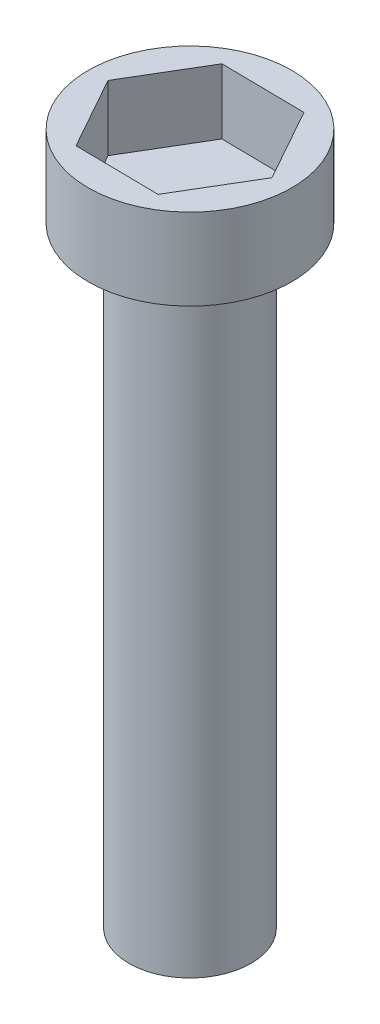
ISO-10303-21;
HEADER;
FILE_DESCRIPTION(('STEP AP214'),'2;1');
FILE_NAME('part.step','',(''),(''),'','','');
FILE_SCHEMA(('AUTOMOTIVE_DESIGN { 1 0 10303 214 1 1 1 1 }'));
ENDSEC;
DATA;
#1=APPLICATION_CONTEXT('core data for automotive mechanical design processes');
#2=APPLICATION_PROTOCOL_DEFINITION('international standard','automotive_design',2000,#1);
#3=PRODUCT_CONTEXT('',#1,'mechanical');
#4=PRODUCT('Part','Part','',(#3));
#5=PRODUCT_RELATED_PRODUCT_CATEGORY('part','',(#4));
#6=PRODUCT_DEFINITION_FORMATION('','',#4);
#7=PRODUCT_DEFINITION_CONTEXT('part definition',#1,'design');
#8=PRODUCT_DEFINITION('design','',#6,#7);
#9=PRODUCT_DEFINITION_SHAPE('','',#8);
#10=(LENGTH_UNIT() NAMED_UNIT(*) SI_UNIT(.MILLI.,.METRE.));
#11=(NAMED_UNIT(*) PLANE_ANGLE_UNIT() SI_UNIT($,.RADIAN.));
#12=(NAMED_UNIT(*) SI_UNIT($,.STERADIAN.) SOLID_ANGLE_UNIT());
#13=UNCERTAINTY_MEASURE_WITH_UNIT(LENGTH_MEASURE(1.E-05),#10,'distance_accuracy_value','');
#14=(GEOMETRIC_REPRESENTATION_CONTEXT(3) GLOBAL_UNCERTAINTY_ASSIGNED_CONTEXT((#13)) GLOBAL_UNIT_ASSIGNED_CONTEXT((#10,
#11,#12)) REPRESENTATION_CONTEXT('',''));
#15=CARTESIAN_POINT('',(0.,0.,0.));
#16=DIRECTION('',(0.,0.,1.));
#17=DIRECTION('',(1.,0.,0.));
#18=AXIS2_PLACEMENT_3D('',#15,#16,#17);
#19=CARTESIAN_POINT('',(0.,15.,0.));
#20=DIRECTION('',(0.,-1.,0.));
#21=DIRECTION('',(0.,0.,-1.));
#22=AXIS2_PLACEMENT_3D('',#19,#20,#21);
#23=CYLINDRICAL_SURFACE('',#22,1.5);
#24=CARTESIAN_POINT('',(0.,15.,0.));
#25=DIRECTION('',(0.,1.,0.));
#26=DIRECTION('',(0.,0.,1.));
#27=AXIS2_PLACEMENT_3D('',#24,#25,#26);
#28=CIRCLE('',#27,1.5);
#29=CARTESIAN_POINT('',(0.,15.,1.5));
#30=VERTEX_POINT('',#29);
#31=EDGE_CURVE('E11',#30,#30,#28,.T.);
#32=ORIENTED_EDGE('',*,*,#31,.F.);
#33=EDGE_LOOP('',(#32));
#34=FACE_BOUND('',#33,.T.);
#35=CARTESIAN_POINT('',(0.,0.,0.));
#36=DIRECTION('',(0.,1.,0.));
#37=DIRECTION('',(0.,0.,1.));
#38=AXIS2_PLACEMENT_3D('',#35,#36,#37);
#39=CIRCLE('',#38,1.5);
#40=CARTESIAN_POINT('',(0.,0.,1.5));
#41=VERTEX_POINT('',#40);
#42=EDGE_CURVE('E46',#41,#41,#39,.T.);
#43=ORIENTED_EDGE('',*,*,#42,.T.);
#44=EDGE_LOOP('',(#43));
#45=FACE_BOUND('',#44,.T.);
#46=ADVANCED_FACE('F43',(#34,#45),#23,.T.);
#47=CARTESIAN_POINT('',(0.,0.,0.));
#48=DIRECTION('',(0.,1.,0.));
#49=DIRECTION('',(0.,0.,1.));
#50=AXIS2_PLACEMENT_3D('',#47,#48,#49);
#51=PLANE('',#50);
#52=ORIENTED_EDGE('',*,*,#42,.F.);
#53=EDGE_LOOP('',(#52));
#54=FACE_BOUND('',#53,.T.);
#55=ADVANCED_FACE('F193',(#54),#51,.F.);
#56=CARTESIAN_POINT('',(0.,17.,0.));
#57=DIRECTION('',(0.,-1.,0.));
#58=DIRECTION('',(0.,0.,-1.));
#59=AXIS2_PLACEMENT_3D('',#56,#57,#58);
#60=CYLINDRICAL_SURFACE('',#59,2.5);
#61=CARTESIAN_POINT('',(0.,17.,0.));
#62=DIRECTION('',(0.,1.,0.));
#63=DIRECTION('',(0.,0.,1.));
#64=AXIS2_PLACEMENT_3D('',#61,#62,#63);
#65=CIRCLE('',#64,2.5);
#66=CARTESIAN_POINT('',(0.,17.,2.5));
#67=VERTEX_POINT('',#66);
#68=EDGE_CURVE('E167',#67,#67,#65,.T.);
#69=ORIENTED_EDGE('',*,*,#68,.F.);
#70=EDGE_LOOP('',(#69));
#71=FACE_BOUND('',#70,.T.);
#72=CARTESIAN_POINT('',(0.,15.,0.));
#73=DIRECTION('',(0.,1.,0.));
#74=DIRECTION('',(0.,0.,1.));
#75=AXIS2_PLACEMENT_3D('',#72,#73,#74);
#76=CIRCLE('',#75,2.5);
#77=CARTESIAN_POINT('',(0.,15.,2.5));
#78=VERTEX_POINT('',#77);
#79=EDGE_CURVE('E157',#78,#78,#76,.T.);
#80=ORIENTED_EDGE('',*,*,#79,.T.);
#81=EDGE_LOOP('',(#80));
#82=FACE_BOUND('',#81,.T.);
#83=ADVANCED_FACE('F175',(#71,#82),#60,.T.);
#84=CARTESIAN_POINT('',(0.,17.,0.));
#85=DIRECTION('',(0.,1.,0.));
#86=DIRECTION('',(0.,0.,1.));
#87=AXIS2_PLACEMENT_3D('',#84,#85,#86);
#88=PLANE('',#87);
#89=DIRECTION('',(0.999910905466136,0.,0.013348450467837));
#90=VECTOR('',#89,1.);
#91=CARTESIAN_POINT('',(-1.04431865035052,17.,1.75430812493096));
#92=LINE('',#91,#90);
#93=CARTESIAN_POINT('',(-1.04431865035052,17.,1.75430812493096));
#94=VERTEX_POINT('',#93);
#95=CARTESIAN_POINT('',(0.997116077080399,17.,1.78156054331491));
#96=VERTEX_POINT('',#95);
#97=EDGE_CURVE('E58',#94,#96,#92,.T.);
#98=ORIENTED_EDGE('',*,*,#97,.F.);
#99=DIRECTION('',(0.488395355526763,0.,0.872622470888692));
#100=VECTOR('',#99,1.);
#101=CARTESIAN_POINT('',(-2.04143472743092,17.,-0.0272524183839453));
#102=LINE('',#101,#100);
#103=CARTESIAN_POINT('',(-2.04143472743092,17.,-0.0272524183839453));
#104=VERTEX_POINT('',#103);
#105=EDGE_CURVE('E151',#104,#94,#102,.T.);
#106=ORIENTED_EDGE('',*,*,#105,.F.);
#107=DIRECTION('',(-0.511515549939372,0.,0.859274020420856));
#108=VECTOR('',#107,1.);
#109=CARTESIAN_POINT('',(-0.9971160770804,17.,-1.78156054331491));
#110=LINE('',#109,#108);
#111=CARTESIAN_POINT('',(-0.9971160770804,17.,-1.78156054331491));
#112=VERTEX_POINT('',#111);
#113=EDGE_CURVE('E148',#112,#104,#110,.T.);
#114=ORIENTED_EDGE('',*,*,#113,.F.);
#115=DIRECTION('',(-0.999910905466136,0.,-0.0133484504678369));
#116=VECTOR('',#115,1.);
#117=CARTESIAN_POINT('',(1.04431865035052,17.,-1.75430812493096));
#118=LINE('',#117,#116);
#119=CARTESIAN_POINT('',(1.04431865035052,17.,-1.75430812493096));
#120=VERTEX_POINT('',#119);
#121=EDGE_CURVE('E106',#120,#112,#118,.T.);
#122=ORIENTED_EDGE('',*,*,#121,.F.);
#123=DIRECTION('',(-0.488395355526763,0.,-0.872622470888692));
#124=VECTOR('',#123,1.);
#125=CARTESIAN_POINT('',(2.04143472743092,17.,0.027252418383946));
#126=LINE('',#125,#124);
#127=CARTESIAN_POINT('',(2.04143472743092,17.,0.027252418383946));
#128=VERTEX_POINT('',#127);
#129=EDGE_CURVE('E142',#128,#120,#126,.T.);
#130=ORIENTED_EDGE('',*,*,#129,.F.);
#131=DIRECTION('',(0.511515549939373,0.,-0.859274020420856));
#132=VECTOR('',#131,1.);
#133=CARTESIAN_POINT('',(0.997116077080399,17.,1.78156054331491));
#134=LINE('',#133,#132);
#135=EDGE_CURVE('E138',#96,#128,#134,.T.);
#136=ORIENTED_EDGE('',*,*,#135,.F.);
#137=EDGE_LOOP('',(#98,#106,#114,#122,#130,#136));
#138=FACE_BOUND('',#137,.T.);
#139=ORIENTED_EDGE('',*,*,#68,.T.);
#140=EDGE_LOOP('',(#139));
#141=FACE_BOUND('',#140,.T.);
#142=ADVANCED_FACE('F180',(#138,#141),#88,.T.);
#143=CARTESIAN_POINT('',(0.,15.,0.));
#144=DIRECTION('',(0.,1.,0.));
#145=DIRECTION('',(0.,0.,1.));
#146=AXIS2_PLACEMENT_3D('',#143,#144,#145);
#147=PLANE('',#146);
#148=ORIENTED_EDGE('',*,*,#31,.T.);
#149=EDGE_LOOP('',(#148));
#150=FACE_BOUND('',#149,.T.);
#151=ORIENTED_EDGE('',*,*,#79,.F.);
#152=EDGE_LOOP('',(#151));
#153=FACE_BOUND('',#152,.T.);
#154=ADVANCED_FACE('F177',(#150,#153),#147,.F.);
#155=CARTESIAN_POINT('',(-1.04431865035052,15.4,1.75430812493096));
#156=DIRECTION('',(-0.013348450467837,0.,0.999910905466136));
#157=DIRECTION('',(0.999910905466136,0.,0.013348450467837));
#158=AXIS2_PLACEMENT_3D('',#155,#156,#157);
#159=PLANE('',#158);
#160=ORIENTED_EDGE('',*,*,#97,.T.);
#161=DIRECTION('',(0.,1.,0.));
#162=VECTOR('',#161,1.);
#163=CARTESIAN_POINT('',(0.997116077080399,15.4,1.78156054331491));
#164=LINE('',#163,#162);
#165=CARTESIAN_POINT('',(0.997116077080399,15.4,1.78156054331491));
#166=VERTEX_POINT('',#165);
#167=EDGE_CURVE('E88',#166,#96,#164,.T.);
#168=ORIENTED_EDGE('',*,*,#167,.F.);
#169=DIRECTION('',(0.999910905466136,0.,0.013348450467837));
#170=VECTOR('',#169,1.);
#171=CARTESIAN_POINT('',(-1.04431865035052,15.4,1.75430812493096));
#172=LINE('',#171,#170);
#173=CARTESIAN_POINT('',(-1.04431865035052,15.4,1.75430812493096));
#174=VERTEX_POINT('',#173);
#175=EDGE_CURVE('E154',#174,#166,#172,.T.);
#176=ORIENTED_EDGE('',*,*,#175,.F.);
#177=DIRECTION('',(0.,1.,0.));
#178=VECTOR('',#177,1.);
#179=CARTESIAN_POINT('',(-1.04431865035052,15.4,1.75430812493096));
#180=LINE('',#179,#178);
#181=EDGE_CURVE('E66',#174,#94,#180,.T.);
#182=ORIENTED_EDGE('',*,*,#181,.T.);
#183=EDGE_LOOP('',(#160,#168,#176,#182));
#184=FACE_BOUND('',#183,.T.);
#185=ADVANCED_FACE('F179',(#184),#159,.F.);
#186=CARTESIAN_POINT('',(-2.04143472743092,15.4,-0.0272524183839453));
#187=DIRECTION('',(-0.872622470888692,0.,0.488395355526763));
#188=DIRECTION('',(0.488395355526763,0.,0.872622470888692));
#189=AXIS2_PLACEMENT_3D('',#186,#187,#188);
#190=PLANE('',#189);
#191=ORIENTED_EDGE('',*,*,#105,.T.);
#192=ORIENTED_EDGE('',*,*,#181,.F.);
#193=DIRECTION('',(0.488395355526763,0.,0.872622470888692));
#194=VECTOR('',#193,1.);
#195=CARTESIAN_POINT('',(-2.04143472743092,15.4,-0.0272524183839453));
#196=LINE('',#195,#194);
#197=CARTESIAN_POINT('',(-2.04143472743092,15.4,-0.0272524183839453));
#198=VERTEX_POINT('',#197);
#199=EDGE_CURVE('E120',#198,#174,#196,.T.);
#200=ORIENTED_EDGE('',*,*,#199,.F.);
#201=DIRECTION('',(0.,1.,0.));
#202=VECTOR('',#201,1.);
#203=CARTESIAN_POINT('',(-2.04143472743092,15.4,-0.0272524183839453));
#204=LINE('',#203,#202);
#205=EDGE_CURVE('E111',#198,#104,#204,.T.);
#206=ORIENTED_EDGE('',*,*,#205,.T.);
#207=EDGE_LOOP('',(#191,#192,#200,#206));
#208=FACE_BOUND('',#207,.T.);
#209=ADVANCED_FACE('F187',(#208),#190,.F.);
#210=CARTESIAN_POINT('',(-0.9971160770804,15.4,-1.78156054331491));
#211=DIRECTION('',(-0.859274020420856,0.,-0.511515549939372));
#212=DIRECTION('',(-0.511515549939372,0.,0.859274020420856));
#213=AXIS2_PLACEMENT_3D('',#210,#211,#212);
#214=PLANE('',#213);
#215=ORIENTED_EDGE('',*,*,#113,.T.);
#216=ORIENTED_EDGE('',*,*,#205,.F.);
#217=DIRECTION('',(-0.511515549939372,0.,0.859274020420856));
#218=VECTOR('',#217,1.);
#219=CARTESIAN_POINT('',(-0.9971160770804,15.4,-1.78156054331491));
#220=LINE('',#219,#218);
#221=CARTESIAN_POINT('',(-0.9971160770804,15.4,-1.78156054331491));
#222=VERTEX_POINT('',#221);
#223=EDGE_CURVE('E115',#222,#198,#220,.T.);
#224=ORIENTED_EDGE('',*,*,#223,.F.);
#225=DIRECTION('',(0.,1.,0.));
#226=VECTOR('',#225,1.);
#227=CARTESIAN_POINT('',(-0.9971160770804,15.4,-1.78156054331491));
#228=LINE('',#227,#226);
#229=EDGE_CURVE('E99',#222,#112,#228,.T.);
#230=ORIENTED_EDGE('',*,*,#229,.T.);
#231=EDGE_LOOP('',(#215,#216,#224,#230));
#232=FACE_BOUND('',#231,.T.);
#233=ADVANCED_FACE('F116',(#232),#214,.F.);
#234=CARTESIAN_POINT('',(1.04431865035052,15.4,-1.75430812493096));
#235=DIRECTION('',(0.0133484504678369,0.,-0.999910905466136));
#236=DIRECTION('',(-0.999910905466136,0.,-0.0133484504678369));
#237=AXIS2_PLACEMENT_3D('',#234,#235,#236);
#238=PLANE('',#237);
#239=ORIENTED_EDGE('',*,*,#121,.T.);
#240=ORIENTED_EDGE('',*,*,#229,.F.);
#241=DIRECTION('',(-0.999910905466136,0.,-0.0133484504678369));
#242=VECTOR('',#241,1.);
#243=CARTESIAN_POINT('',(1.04431865035052,15.4,-1.75430812493096));
#244=LINE('',#243,#242);
#245=CARTESIAN_POINT('',(1.04431865035052,15.4,-1.75430812493096));
#246=VERTEX_POINT('',#245);
#247=EDGE_CURVE('E103',#246,#222,#244,.T.);
#248=ORIENTED_EDGE('',*,*,#247,.F.);
#249=DIRECTION('',(0.,1.,0.));
#250=VECTOR('',#249,1.);
#251=CARTESIAN_POINT('',(1.04431865035052,15.4,-1.75430812493096));
#252=LINE('',#251,#250);
#253=EDGE_CURVE('E112',#246,#120,#252,.T.);
#254=ORIENTED_EDGE('',*,*,#253,.T.);
#255=EDGE_LOOP('',(#239,#240,#248,#254));
#256=FACE_BOUND('',#255,.T.);
#257=ADVANCED_FACE('F101',(#256),#238,.F.);
#258=CARTESIAN_POINT('',(2.04143472743092,15.4,0.027252418383946));
#259=DIRECTION('',(0.872622470888692,0.,-0.488395355526763));
#260=DIRECTION('',(-0.488395355526763,0.,-0.872622470888693));
#261=AXIS2_PLACEMENT_3D('',#258,#259,#260);
#262=PLANE('',#261);
#263=ORIENTED_EDGE('',*,*,#129,.T.);
#264=ORIENTED_EDGE('',*,*,#253,.F.);
#265=DIRECTION('',(-0.488395355526763,0.,-0.872622470888692));
#266=VECTOR('',#265,1.);
#267=CARTESIAN_POINT('',(2.04143472743092,15.4,0.027252418383946));
#268=LINE('',#267,#266);
#269=CARTESIAN_POINT('',(2.04143472743092,15.4,0.027252418383946));
#270=VERTEX_POINT('',#269);
#271=EDGE_CURVE('E126',#270,#246,#268,.T.);
#272=ORIENTED_EDGE('',*,*,#271,.F.);
#273=DIRECTION('',(0.,1.,0.));
#274=VECTOR('',#273,1.);
#275=CARTESIAN_POINT('',(2.04143472743092,15.4,0.027252418383946));
#276=LINE('',#275,#274);
#277=EDGE_CURVE('E162',#270,#128,#276,.T.);
#278=ORIENTED_EDGE('',*,*,#277,.T.);
#279=EDGE_LOOP('',(#263,#264,#272,#278));
#280=FACE_BOUND('',#279,.T.);
#281=ADVANCED_FACE('F253',(#280),#262,.F.);
#282=CARTESIAN_POINT('',(0.997116077080399,15.4,1.78156054331491));
#283=DIRECTION('',(0.859274020420856,0.,0.511515549939373));
#284=DIRECTION('',(0.511515549939373,0.,-0.859274020420856));
#285=AXIS2_PLACEMENT_3D('',#282,#283,#284);
#286=PLANE('',#285);
#287=ORIENTED_EDGE('',*,*,#135,.T.);
#288=ORIENTED_EDGE('',*,*,#277,.F.);
#289=DIRECTION('',(0.511515549939373,0.,-0.859274020420856));
#290=VECTOR('',#289,1.);
#291=CARTESIAN_POINT('',(0.997116077080399,15.4,1.78156054331491));
#292=LINE('',#291,#290);
#293=EDGE_CURVE('E130',#166,#270,#292,.T.);
#294=ORIENTED_EDGE('',*,*,#293,.F.);
#295=ORIENTED_EDGE('',*,*,#167,.T.);
#296=EDGE_LOOP('',(#287,#288,#294,#295));
#297=FACE_BOUND('',#296,.T.);
#298=ADVANCED_FACE('F263',(#297),#286,.F.);
#299=CARTESIAN_POINT('',(0.,15.4,0.));
#300=DIRECTION('',(0.,1.,0.));
#301=DIRECTION('',(0.,0.,1.));
#302=AXIS2_PLACEMENT_3D('',#299,#300,#301);
#303=PLANE('',#302);
#304=ORIENTED_EDGE('',*,*,#175,.T.);
#305=ORIENTED_EDGE('',*,*,#293,.T.);
#306=ORIENTED_EDGE('',*,*,#271,.T.);
#307=ORIENTED_EDGE('',*,*,#247,.T.);
#308=ORIENTED_EDGE('',*,*,#223,.T.);
#309=ORIENTED_EDGE('',*,*,#199,.T.);
#310=EDGE_LOOP('',(#304,#305,#306,#307,#308,#309));
#311=FACE_BOUND('',#310,.T.);
#312=ADVANCED_FACE('F123',(#311),#303,.T.);
#313=CLOSED_SHELL('',(#46,#55,#83,#142,#154,#185,#209,#233,#257,#281,#298,#312));
#314=MANIFOLD_SOLID_BREP('B2',#313);
#315=ADVANCED_BREP_SHAPE_REPRESENTATION('',(#18,#314),#14);
#316=SHAPE_DEFINITION_REPRESENTATION(#9,#315);
ENDSEC;
END-ISO-10303-21;
